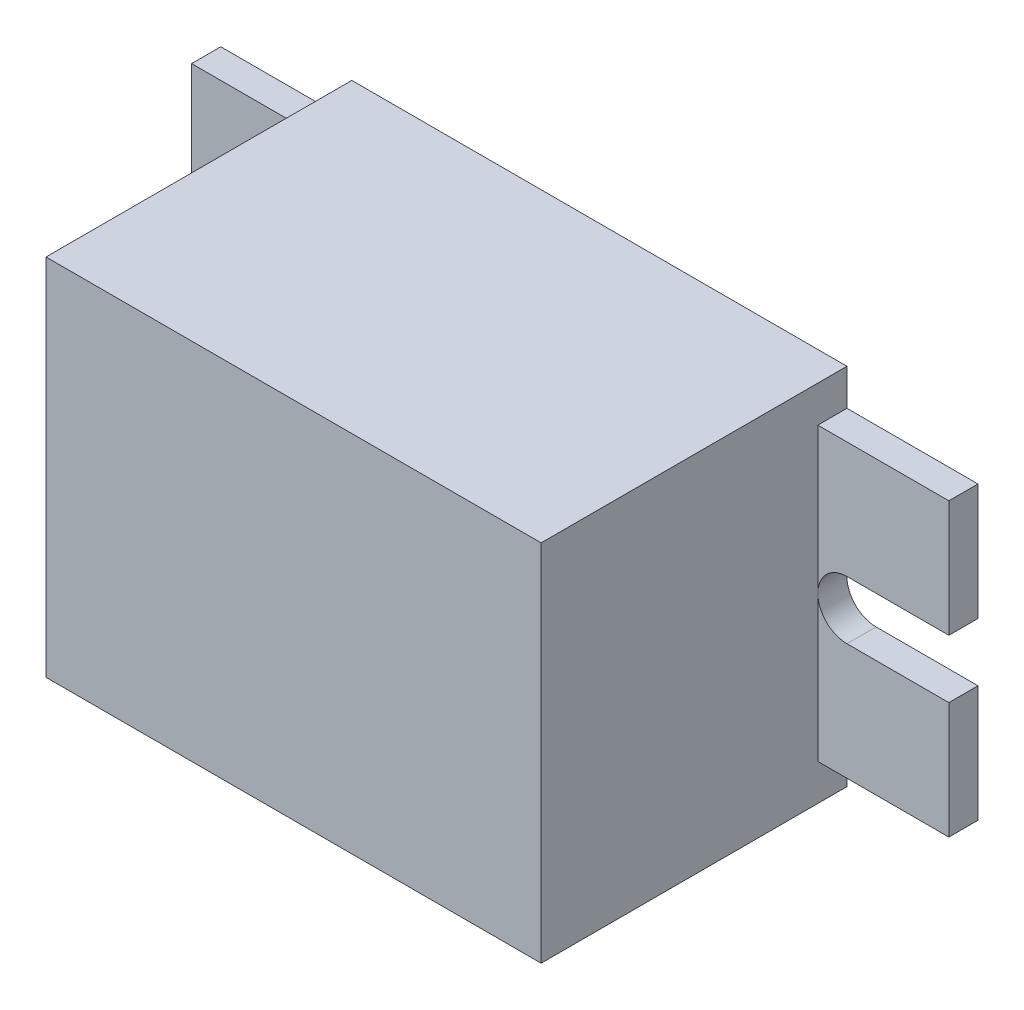
ISO-10303-21;
HEADER;
FILE_DESCRIPTION(('STEP AP214'),'2;1');
FILE_NAME('part.step','',(''),(''),'','','');
FILE_SCHEMA(('AUTOMOTIVE_DESIGN { 1 0 10303 214 1 1 1 1 }'));
ENDSEC;
DATA;
#1=APPLICATION_CONTEXT('core data for automotive mechanical design processes');
#2=APPLICATION_PROTOCOL_DEFINITION('international standard','automotive_design',2000,#1);
#3=PRODUCT_CONTEXT('',#1,'mechanical');
#4=PRODUCT('Part','Part','',(#3));
#5=PRODUCT_RELATED_PRODUCT_CATEGORY('part','',(#4));
#6=PRODUCT_DEFINITION_FORMATION('','',#4);
#7=PRODUCT_DEFINITION_CONTEXT('part definition',#1,'design');
#8=PRODUCT_DEFINITION('design','',#6,#7);
#9=PRODUCT_DEFINITION_SHAPE('','',#8);
#10=(LENGTH_UNIT() NAMED_UNIT(*) SI_UNIT(.MILLI.,.METRE.));
#11=(NAMED_UNIT(*) PLANE_ANGLE_UNIT() SI_UNIT($,.RADIAN.));
#12=(NAMED_UNIT(*) SI_UNIT($,.STERADIAN.) SOLID_ANGLE_UNIT());
#13=UNCERTAINTY_MEASURE_WITH_UNIT(LENGTH_MEASURE(1.E-05),#10,'distance_accuracy_value','');
#14=(GEOMETRIC_REPRESENTATION_CONTEXT(3) GLOBAL_UNCERTAINTY_ASSIGNED_CONTEXT((#13)) GLOBAL_UNIT_ASSIGNED_CONTEXT((#10,
#11,#12)) REPRESENTATION_CONTEXT('',''));
#15=CARTESIAN_POINT('',(0.,0.,0.));
#16=DIRECTION('',(0.,0.,1.));
#17=DIRECTION('',(1.,0.,0.));
#18=AXIS2_PLACEMENT_3D('',#15,#16,#17);
#19=CARTESIAN_POINT('',(34.,0.,21.));
#20=DIRECTION('',(-1.,0.,0.));
#21=DIRECTION('',(0.,-1.,0.));
#22=AXIS2_PLACEMENT_3D('',#19,#20,#21);
#23=PLANE('',#22);
#24=DIRECTION('',(0.,-1.,0.));
#25=VECTOR('',#24,1.);
#26=CARTESIAN_POINT('',(34.,0.,2.));
#27=LINE('',#26,#25);
#28=CARTESIAN_POINT('',(34.,22.5,2.));
#29=VERTEX_POINT('',#28);
#30=CARTESIAN_POINT('',(34.,12.5,2.));
#31=VERTEX_POINT('',#30);
#32=EDGE_CURVE('E50',#29,#31,#27,.T.);
#33=ORIENTED_EDGE('',*,*,#32,.F.);
#34=DIRECTION('',(0.,0.,-1.));
#35=VECTOR('',#34,1.);
#36=CARTESIAN_POINT('',(34.,22.5,2.));
#37=LINE('',#36,#35);
#38=CARTESIAN_POINT('',(34.,22.5,0.));
#39=VERTEX_POINT('',#38);
#40=EDGE_CURVE('E54',#29,#39,#37,.T.);
#41=ORIENTED_EDGE('',*,*,#40,.T.);
#42=DIRECTION('',(0.,1.,0.));
#43=VECTOR('',#42,1.);
#44=CARTESIAN_POINT('',(34.,0.,0.));
#45=LINE('',#44,#43);
#46=CARTESIAN_POINT('',(34.,25.,0.));
#47=VERTEX_POINT('',#46);
#48=EDGE_CURVE('E200',#39,#47,#45,.T.);
#49=ORIENTED_EDGE('',*,*,#48,.T.);
#50=DIRECTION('',(0.,0.,-1.));
#51=VECTOR('',#50,1.);
#52=CARTESIAN_POINT('',(34.,25.,21.));
#53=LINE('',#52,#51);
#54=CARTESIAN_POINT('',(34.,25.,21.));
#55=VERTEX_POINT('',#54);
#56=EDGE_CURVE('E332',#55,#47,#53,.T.);
#57=ORIENTED_EDGE('',*,*,#56,.F.);
#58=DIRECTION('',(0.,1.,0.));
#59=VECTOR('',#58,1.);
#60=CARTESIAN_POINT('',(34.,0.,21.));
#61=LINE('',#60,#59);
#62=CARTESIAN_POINT('',(34.,0.,21.));
#63=VERTEX_POINT('',#62);
#64=EDGE_CURVE('E318',#63,#55,#61,.T.);
#65=ORIENTED_EDGE('',*,*,#64,.F.);
#66=DIRECTION('',(0.,0.,-1.));
#67=VECTOR('',#66,1.);
#68=CARTESIAN_POINT('',(34.,0.,21.));
#69=LINE('',#68,#67);
#70=CARTESIAN_POINT('',(34.,0.,0.));
#71=VERTEX_POINT('',#70);
#72=EDGE_CURVE('E43',#63,#71,#69,.T.);
#73=ORIENTED_EDGE('',*,*,#72,.T.);
#74=CARTESIAN_POINT('',(34.,2.5,0.));
#75=VERTEX_POINT('',#74);
#76=EDGE_CURVE('E327',#71,#75,#45,.T.);
#77=ORIENTED_EDGE('',*,*,#76,.T.);
#78=DIRECTION('',(0.,0.,-1.));
#79=VECTOR('',#78,1.);
#80=CARTESIAN_POINT('',(34.,2.5,2.));
#81=LINE('',#80,#79);
#82=CARTESIAN_POINT('',(34.,2.5,2.));
#83=VERTEX_POINT('',#82);
#84=EDGE_CURVE('E247',#83,#75,#81,.T.);
#85=ORIENTED_EDGE('',*,*,#84,.F.);
#86=DIRECTION('',(0.,-1.,0.));
#87=VECTOR('',#86,1.);
#88=CARTESIAN_POINT('',(34.,0.,2.));
#89=LINE('',#88,#87);
#90=EDGE_CURVE('E219',#31,#83,#89,.T.);
#91=ORIENTED_EDGE('',*,*,#90,.F.);
#92=EDGE_LOOP('',(#33,#41,#49,#57,#65,#73,#77,#85,#91));
#93=FACE_BOUND('',#92,.T.);
#94=ADVANCED_FACE('F35',(#93),#23,.F.);
#95=CARTESIAN_POINT('',(0.,0.,21.));
#96=DIRECTION('',(1.,0.,0.));
#97=DIRECTION('',(0.,1.,0.));
#98=AXIS2_PLACEMENT_3D('',#95,#96,#97);
#99=PLANE('',#98);
#100=DIRECTION('',(0.,-1.,0.));
#101=VECTOR('',#100,1.);
#102=CARTESIAN_POINT('',(0.,0.,2.));
#103=LINE('',#102,#101);
#104=CARTESIAN_POINT('',(0.,12.5,2.));
#105=VERTEX_POINT('',#104);
#106=CARTESIAN_POINT('',(0.,2.49999999999999,2.));
#107=VERTEX_POINT('',#106);
#108=EDGE_CURVE('E250',#105,#107,#103,.T.);
#109=ORIENTED_EDGE('',*,*,#108,.T.);
#110=DIRECTION('',(0.,0.,-1.));
#111=VECTOR('',#110,1.);
#112=CARTESIAN_POINT('',(0.,2.5,2.));
#113=LINE('',#112,#111);
#114=CARTESIAN_POINT('',(0.,2.49999999999999,0.));
#115=VERTEX_POINT('',#114);
#116=EDGE_CURVE('E263',#107,#115,#113,.T.);
#117=ORIENTED_EDGE('',*,*,#116,.T.);
#118=DIRECTION('',(0.,-1.,0.));
#119=VECTOR('',#118,1.);
#120=CARTESIAN_POINT('',(0.,0.,0.));
#121=LINE('',#120,#119);
#122=CARTESIAN_POINT('',(0.,0.,0.));
#123=VERTEX_POINT('',#122);
#124=EDGE_CURVE('E311',#115,#123,#121,.T.);
#125=ORIENTED_EDGE('',*,*,#124,.T.);
#126=DIRECTION('',(0.,0.,-1.));
#127=VECTOR('',#126,1.);
#128=CARTESIAN_POINT('',(0.,0.,21.));
#129=LINE('',#128,#127);
#130=CARTESIAN_POINT('',(0.,0.,21.));
#131=VERTEX_POINT('',#130);
#132=EDGE_CURVE('E11',#131,#123,#129,.T.);
#133=ORIENTED_EDGE('',*,*,#132,.F.);
#134=DIRECTION('',(0.,-1.,0.));
#135=VECTOR('',#134,1.);
#136=CARTESIAN_POINT('',(0.,0.,21.));
#137=LINE('',#136,#135);
#138=CARTESIAN_POINT('',(0.,25.,21.));
#139=VERTEX_POINT('',#138);
#140=EDGE_CURVE('E312',#139,#131,#137,.T.);
#141=ORIENTED_EDGE('',*,*,#140,.F.);
#142=DIRECTION('',(0.,0.,-1.));
#143=VECTOR('',#142,1.);
#144=CARTESIAN_POINT('',(0.,25.,21.));
#145=LINE('',#144,#143);
#146=CARTESIAN_POINT('',(0.,25.,0.));
#147=VERTEX_POINT('',#146);
#148=EDGE_CURVE('E322',#139,#147,#145,.T.);
#149=ORIENTED_EDGE('',*,*,#148,.T.);
#150=CARTESIAN_POINT('',(0.,22.5,0.));
#151=VERTEX_POINT('',#150);
#152=EDGE_CURVE('E323',#147,#151,#121,.T.);
#153=ORIENTED_EDGE('',*,*,#152,.T.);
#154=DIRECTION('',(0.,0.,-1.));
#155=VECTOR('',#154,1.);
#156=CARTESIAN_POINT('',(0.,22.5,2.));
#157=LINE('',#156,#155);
#158=CARTESIAN_POINT('',(0.,22.5,2.));
#159=VERTEX_POINT('',#158);
#160=EDGE_CURVE('E306',#159,#151,#157,.T.);
#161=ORIENTED_EDGE('',*,*,#160,.F.);
#162=DIRECTION('',(0.,-1.,0.));
#163=VECTOR('',#162,1.);
#164=CARTESIAN_POINT('',(0.,0.,2.));
#165=LINE('',#164,#163);
#166=EDGE_CURVE('E287',#159,#105,#165,.T.);
#167=ORIENTED_EDGE('',*,*,#166,.T.);
#168=EDGE_LOOP('',(#109,#117,#125,#133,#141,#149,#153,#161,#167));
#169=FACE_BOUND('',#168,.T.);
#170=ADVANCED_FACE('F37',(#169),#99,.F.);
#171=CARTESIAN_POINT('',(0.,0.,21.));
#172=DIRECTION('',(0.,1.,0.));
#173=DIRECTION('',(0.,0.,1.));
#174=AXIS2_PLACEMENT_3D('',#171,#172,#173);
#175=PLANE('',#174);
#176=DIRECTION('',(1.,0.,0.));
#177=VECTOR('',#176,1.);
#178=CARTESIAN_POINT('',(0.,0.,0.));
#179=LINE('',#178,#177);
#180=EDGE_CURVE('E325',#123,#71,#179,.T.);
#181=ORIENTED_EDGE('',*,*,#180,.T.);
#182=ORIENTED_EDGE('',*,*,#72,.F.);
#183=DIRECTION('',(1.,0.,0.));
#184=VECTOR('',#183,1.);
#185=CARTESIAN_POINT('',(0.,0.,21.));
#186=LINE('',#185,#184);
#187=EDGE_CURVE('E315',#131,#63,#186,.T.);
#188=ORIENTED_EDGE('',*,*,#187,.F.);
#189=ORIENTED_EDGE('',*,*,#132,.T.);
#190=EDGE_LOOP('',(#181,#182,#188,#189));
#191=FACE_BOUND('',#190,.T.);
#192=ADVANCED_FACE('F382',(#191),#175,.F.);
#193=CARTESIAN_POINT('',(0.,25.,21.));
#194=DIRECTION('',(0.,-1.,0.));
#195=DIRECTION('',(0.,0.,-1.));
#196=AXIS2_PLACEMENT_3D('',#193,#194,#195);
#197=PLANE('',#196);
#198=DIRECTION('',(-1.,0.,0.));
#199=VECTOR('',#198,1.);
#200=CARTESIAN_POINT('',(0.,25.,0.));
#201=LINE('',#200,#199);
#202=EDGE_CURVE('E316',#47,#147,#201,.T.);
#203=ORIENTED_EDGE('',*,*,#202,.T.);
#204=ORIENTED_EDGE('',*,*,#148,.F.);
#205=DIRECTION('',(-1.,0.,0.));
#206=VECTOR('',#205,1.);
#207=CARTESIAN_POINT('',(0.,25.,21.));
#208=LINE('',#207,#206);
#209=EDGE_CURVE('E320',#55,#139,#208,.T.);
#210=ORIENTED_EDGE('',*,*,#209,.F.);
#211=ORIENTED_EDGE('',*,*,#56,.T.);
#212=EDGE_LOOP('',(#203,#204,#210,#211));
#213=FACE_BOUND('',#212,.T.);
#214=ADVANCED_FACE('F385',(#213),#197,.F.);
#215=CARTESIAN_POINT('',(0.,0.,21.));
#216=DIRECTION('',(0.,0.,-1.));
#217=DIRECTION('',(-1.,0.,0.));
#218=AXIS2_PLACEMENT_3D('',#215,#216,#217);
#219=PLANE('',#218);
#220=ORIENTED_EDGE('',*,*,#140,.T.);
#221=ORIENTED_EDGE('',*,*,#187,.T.);
#222=ORIENTED_EDGE('',*,*,#64,.T.);
#223=ORIENTED_EDGE('',*,*,#209,.T.);
#224=EDGE_LOOP('',(#220,#221,#222,#223));
#225=FACE_BOUND('',#224,.T.);
#226=ADVANCED_FACE('F391',(#225),#219,.F.);
#227=CARTESIAN_POINT('',(0.,0.,0.));
#228=DIRECTION('',(0.,0.,-1.));
#229=DIRECTION('',(-1.,0.,0.));
#230=AXIS2_PLACEMENT_3D('',#227,#228,#229);
#231=PLANE('',#230);
#232=ORIENTED_EDGE('',*,*,#152,.F.);
#233=ORIENTED_EDGE('',*,*,#202,.F.);
#234=ORIENTED_EDGE('',*,*,#48,.F.);
#235=DIRECTION('',(1.,0.,0.));
#236=VECTOR('',#235,1.);
#237=CARTESIAN_POINT('',(0.,22.5,0.));
#238=LINE('',#237,#236);
#239=CARTESIAN_POINT('',(43.,22.5,0.));
#240=VERTEX_POINT('',#239);
#241=EDGE_CURVE('E180',#39,#240,#238,.T.);
#242=ORIENTED_EDGE('',*,*,#241,.T.);
#243=DIRECTION('',(0.,-1.,0.));
#244=VECTOR('',#243,1.);
#245=CARTESIAN_POINT('',(43.,0.,0.));
#246=LINE('',#245,#244);
#247=CARTESIAN_POINT('',(43.,14.5,0.));
#248=VERTEX_POINT('',#247);
#249=EDGE_CURVE('E188',#240,#248,#246,.T.);
#250=ORIENTED_EDGE('',*,*,#249,.T.);
#251=DIRECTION('',(1.,0.,0.));
#252=VECTOR('',#251,1.);
#253=CARTESIAN_POINT('',(0.,14.5,0.));
#254=LINE('',#253,#252);
#255=CARTESIAN_POINT('',(36.,14.5,0.));
#256=VERTEX_POINT('',#255);
#257=EDGE_CURVE('E206',#256,#248,#254,.T.);
#258=ORIENTED_EDGE('',*,*,#257,.F.);
#259=CARTESIAN_POINT('',(36.,12.5,0.));
#260=DIRECTION('',(0.,0.,1.));
#261=DIRECTION('',(1.,0.,0.));
#262=AXIS2_PLACEMENT_3D('',#259,#260,#261);
#263=CIRCLE('',#262,2.);
#264=CARTESIAN_POINT('',(36.,10.5,0.));
#265=VERTEX_POINT('',#264);
#266=EDGE_CURVE('E195',#256,#265,#263,.T.);
#267=ORIENTED_EDGE('',*,*,#266,.T.);
#268=DIRECTION('',(1.,0.,0.));
#269=VECTOR('',#268,1.);
#270=CARTESIAN_POINT('',(0.,10.5,0.));
#271=LINE('',#270,#269);
#272=CARTESIAN_POINT('',(43.,10.5,0.));
#273=VERTEX_POINT('',#272);
#274=EDGE_CURVE('E220',#265,#273,#271,.T.);
#275=ORIENTED_EDGE('',*,*,#274,.T.);
#276=DIRECTION('',(0.,-1.,0.));
#277=VECTOR('',#276,1.);
#278=CARTESIAN_POINT('',(43.,0.,0.));
#279=LINE('',#278,#277);
#280=CARTESIAN_POINT('',(43.,2.5,0.));
#281=VERTEX_POINT('',#280);
#282=EDGE_CURVE('E237',#273,#281,#279,.T.);
#283=ORIENTED_EDGE('',*,*,#282,.T.);
#284=DIRECTION('',(1.,0.,0.));
#285=VECTOR('',#284,1.);
#286=CARTESIAN_POINT('',(0.,2.50000000000001,0.));
#287=LINE('',#286,#285);
#288=EDGE_CURVE('E234',#75,#281,#287,.T.);
#289=ORIENTED_EDGE('',*,*,#288,.F.);
#290=ORIENTED_EDGE('',*,*,#76,.F.);
#291=ORIENTED_EDGE('',*,*,#180,.F.);
#292=ORIENTED_EDGE('',*,*,#124,.F.);
#293=DIRECTION('',(-1.,0.,0.));
#294=VECTOR('',#293,1.);
#295=CARTESIAN_POINT('',(0.,2.5,0.));
#296=LINE('',#295,#294);
#297=CARTESIAN_POINT('',(-9.00000000000001,2.49999999999999,0.));
#298=VERTEX_POINT('',#297);
#299=EDGE_CURVE('E265',#115,#298,#296,.T.);
#300=ORIENTED_EDGE('',*,*,#299,.T.);
#301=DIRECTION('',(0.,-1.,0.));
#302=VECTOR('',#301,1.);
#303=CARTESIAN_POINT('',(-9.00000000000001,0.,0.));
#304=LINE('',#303,#302);
#305=CARTESIAN_POINT('',(-9.00000000000001,10.5,0.));
#306=VERTEX_POINT('',#305);
#307=EDGE_CURVE('E254',#306,#298,#304,.T.);
#308=ORIENTED_EDGE('',*,*,#307,.F.);
#309=DIRECTION('',(-1.,0.,0.));
#310=VECTOR('',#309,1.);
#311=CARTESIAN_POINT('',(0.,10.5,0.));
#312=LINE('',#311,#310);
#313=CARTESIAN_POINT('',(-2.00000000000001,10.5,0.));
#314=VERTEX_POINT('',#313);
#315=EDGE_CURVE('E255',#314,#306,#312,.T.);
#316=ORIENTED_EDGE('',*,*,#315,.F.);
#317=CARTESIAN_POINT('',(-2.00000000000001,12.5,0.));
#318=DIRECTION('',(0.,0.,1.));
#319=DIRECTION('',(1.,0.,0.));
#320=AXIS2_PLACEMENT_3D('',#317,#318,#319);
#321=CIRCLE('',#320,2.);
#322=CARTESIAN_POINT('',(-2.00000000000001,14.5,0.));
#323=VERTEX_POINT('',#322);
#324=EDGE_CURVE('E296',#323,#314,#321,.F.);
#325=ORIENTED_EDGE('',*,*,#324,.F.);
#326=DIRECTION('',(-1.,0.,0.));
#327=VECTOR('',#326,1.);
#328=CARTESIAN_POINT('',(0.,14.5,0.));
#329=LINE('',#328,#327);
#330=CARTESIAN_POINT('',(-9.00000000000001,14.5,0.));
#331=VERTEX_POINT('',#330);
#332=EDGE_CURVE('E268',#323,#331,#329,.T.);
#333=ORIENTED_EDGE('',*,*,#332,.T.);
#334=DIRECTION('',(0.,-1.,0.));
#335=VECTOR('',#334,1.);
#336=CARTESIAN_POINT('',(-9.,0.,0.));
#337=LINE('',#336,#335);
#338=CARTESIAN_POINT('',(-9.00000000000001,22.5,0.));
#339=VERTEX_POINT('',#338);
#340=EDGE_CURVE('E284',#339,#331,#337,.T.);
#341=ORIENTED_EDGE('',*,*,#340,.F.);
#342=DIRECTION('',(-1.,0.,0.));
#343=VECTOR('',#342,1.);
#344=CARTESIAN_POINT('',(0.,22.5,0.));
#345=LINE('',#344,#343);
#346=EDGE_CURVE('E298',#151,#339,#345,.T.);
#347=ORIENTED_EDGE('',*,*,#346,.F.);
#348=EDGE_LOOP('',(#232,#233,#234,#242,#250,#258,#267,#275,#283,#289,#290,#291,#292,#300,#308,
#316,#325,#333,#341,#347));
#349=FACE_BOUND('',#348,.T.);
#350=ADVANCED_FACE('F198',(#349),#231,.T.);
#351=CARTESIAN_POINT('',(0.,14.5,2.));
#352=DIRECTION('',(0.,-1.,0.));
#353=DIRECTION('',(1.,0.,0.));
#354=AXIS2_PLACEMENT_3D('',#351,#352,#353);
#355=PLANE('',#354);
#356=ORIENTED_EDGE('',*,*,#332,.F.);
#357=DIRECTION('',(0.,0.,-1.));
#358=VECTOR('',#357,1.);
#359=CARTESIAN_POINT('',(-2.00000000000001,14.5,2.));
#360=LINE('',#359,#358);
#361=CARTESIAN_POINT('',(-2.00000000000001,14.5,2.));
#362=VERTEX_POINT('',#361);
#363=EDGE_CURVE('E309',#362,#323,#360,.T.);
#364=ORIENTED_EDGE('',*,*,#363,.F.);
#365=DIRECTION('',(-1.,0.,0.));
#366=VECTOR('',#365,1.);
#367=CARTESIAN_POINT('',(0.,14.5,2.));
#368=LINE('',#367,#366);
#369=CARTESIAN_POINT('',(-9.00000000000001,14.5,2.));
#370=VERTEX_POINT('',#369);
#371=EDGE_CURVE('E280',#362,#370,#368,.T.);
#372=ORIENTED_EDGE('',*,*,#371,.T.);
#373=DIRECTION('',(0.,0.,-1.));
#374=VECTOR('',#373,1.);
#375=CARTESIAN_POINT('',(-9.00000000000001,14.5,2.));
#376=LINE('',#375,#374);
#377=EDGE_CURVE('E293',#370,#331,#376,.T.);
#378=ORIENTED_EDGE('',*,*,#377,.T.);
#379=EDGE_LOOP('',(#356,#364,#372,#378));
#380=FACE_BOUND('',#379,.T.);
#381=ADVANCED_FACE('F420',(#380),#355,.T.);
#382=CARTESIAN_POINT('',(-2.00000000000001,12.5,2.));
#383=DIRECTION('',(0.,0.,-1.));
#384=DIRECTION('',(-1.,0.,0.));
#385=AXIS2_PLACEMENT_3D('',#382,#383,#384);
#386=CYLINDRICAL_SURFACE('',#385,2.);
#387=ORIENTED_EDGE('',*,*,#324,.T.);
#388=DIRECTION('',(0.,0.,-1.));
#389=VECTOR('',#388,1.);
#390=CARTESIAN_POINT('',(-2.00000000000001,10.5,2.));
#391=LINE('',#390,#389);
#392=CARTESIAN_POINT('',(-2.00000000000001,10.5,2.));
#393=VERTEX_POINT('',#392);
#394=EDGE_CURVE('E251',#393,#314,#391,.T.);
#395=ORIENTED_EDGE('',*,*,#394,.F.);
#396=CARTESIAN_POINT('',(-2.00000000000001,12.5,2.));
#397=DIRECTION('',(0.,0.,1.));
#398=DIRECTION('',(1.,0.,0.));
#399=AXIS2_PLACEMENT_3D('',#396,#397,#398);
#400=CIRCLE('',#399,2.);
#401=EDGE_CURVE('E262',#105,#393,#400,.F.);
#402=ORIENTED_EDGE('',*,*,#401,.F.);
#403=CARTESIAN_POINT('',(-2.00000000000001,12.5,2.));
#404=DIRECTION('',(0.,0.,1.));
#405=DIRECTION('',(1.,0.,0.));
#406=AXIS2_PLACEMENT_3D('',#403,#404,#405);
#407=CIRCLE('',#406,2.);
#408=EDGE_CURVE('E283',#362,#105,#407,.F.);
#409=ORIENTED_EDGE('',*,*,#408,.F.);
#410=ORIENTED_EDGE('',*,*,#363,.T.);
#411=EDGE_LOOP('',(#387,#395,#402,#409,#410));
#412=FACE_BOUND('',#411,.T.);
#413=ADVANCED_FACE('F415',(#412),#386,.F.);
#414=CARTESIAN_POINT('',(0.,22.5,2.));
#415=DIRECTION('',(0.,-1.,0.));
#416=DIRECTION('',(0.,0.,-1.));
#417=AXIS2_PLACEMENT_3D('',#414,#415,#416);
#418=PLANE('',#417);
#419=ORIENTED_EDGE('',*,*,#346,.T.);
#420=DIRECTION('',(0.,0.,-1.));
#421=VECTOR('',#420,1.);
#422=CARTESIAN_POINT('',(-9.00000000000001,22.5,2.));
#423=LINE('',#422,#421);
#424=CARTESIAN_POINT('',(-9.00000000000001,22.5,2.));
#425=VERTEX_POINT('',#424);
#426=EDGE_CURVE('E303',#425,#339,#423,.T.);
#427=ORIENTED_EDGE('',*,*,#426,.F.);
#428=DIRECTION('',(-1.,0.,0.));
#429=VECTOR('',#428,1.);
#430=CARTESIAN_POINT('',(0.,22.5,2.));
#431=LINE('',#430,#429);
#432=EDGE_CURVE('E289',#159,#425,#431,.T.);
#433=ORIENTED_EDGE('',*,*,#432,.F.);
#434=ORIENTED_EDGE('',*,*,#160,.T.);
#435=EDGE_LOOP('',(#419,#427,#433,#434));
#436=FACE_BOUND('',#435,.T.);
#437=ADVANCED_FACE('F430',(#436),#418,.F.);
#438=CARTESIAN_POINT('',(-9.,0.,2.));
#439=DIRECTION('',(1.,0.,0.));
#440=DIRECTION('',(0.,1.,0.));
#441=AXIS2_PLACEMENT_3D('',#438,#439,#440);
#442=PLANE('',#441);
#443=ORIENTED_EDGE('',*,*,#340,.T.);
#444=ORIENTED_EDGE('',*,*,#377,.F.);
#445=DIRECTION('',(0.,-1.,0.));
#446=VECTOR('',#445,1.);
#447=CARTESIAN_POINT('',(-9.,0.,2.));
#448=LINE('',#447,#446);
#449=EDGE_CURVE('E291',#425,#370,#448,.T.);
#450=ORIENTED_EDGE('',*,*,#449,.F.);
#451=ORIENTED_EDGE('',*,*,#426,.T.);
#452=EDGE_LOOP('',(#443,#444,#450,#451));
#453=FACE_BOUND('',#452,.T.);
#454=ADVANCED_FACE('F425',(#453),#442,.F.);
#455=CARTESIAN_POINT('',(0.,0.,2.));
#456=DIRECTION('',(0.,0.,1.));
#457=DIRECTION('',(1.,0.,0.));
#458=AXIS2_PLACEMENT_3D('',#455,#456,#457);
#459=PLANE('',#458);
#460=ORIENTED_EDGE('',*,*,#371,.F.);
#461=ORIENTED_EDGE('',*,*,#408,.T.);
#462=ORIENTED_EDGE('',*,*,#166,.F.);
#463=ORIENTED_EDGE('',*,*,#432,.T.);
#464=ORIENTED_EDGE('',*,*,#449,.T.);
#465=EDGE_LOOP('',(#460,#461,#462,#463,#464));
#466=FACE_BOUND('',#465,.T.);
#467=ADVANCED_FACE('F449',(#466),#459,.T.);
#468=CARTESIAN_POINT('',(0.,10.5,2.));
#469=DIRECTION('',(0.,-1.,0.));
#470=DIRECTION('',(1.,0.,0.));
#471=AXIS2_PLACEMENT_3D('',#468,#469,#470);
#472=PLANE('',#471);
#473=ORIENTED_EDGE('',*,*,#315,.T.);
#474=DIRECTION('',(0.,0.,-1.));
#475=VECTOR('',#474,1.);
#476=CARTESIAN_POINT('',(-9.00000000000001,10.5,2.));
#477=LINE('',#476,#475);
#478=CARTESIAN_POINT('',(-9.00000000000001,10.5,2.));
#479=VERTEX_POINT('',#478);
#480=EDGE_CURVE('E256',#479,#306,#477,.T.);
#481=ORIENTED_EDGE('',*,*,#480,.F.);
#482=DIRECTION('',(-1.,0.,0.));
#483=VECTOR('',#482,1.);
#484=CARTESIAN_POINT('',(0.,10.5,2.));
#485=LINE('',#484,#483);
#486=EDGE_CURVE('E276',#393,#479,#485,.T.);
#487=ORIENTED_EDGE('',*,*,#486,.F.);
#488=ORIENTED_EDGE('',*,*,#394,.T.);
#489=EDGE_LOOP('',(#473,#481,#487,#488));
#490=FACE_BOUND('',#489,.T.);
#491=ADVANCED_FACE('F410',(#490),#472,.F.);
#492=CARTESIAN_POINT('',(-9.00000000000001,0.,2.));
#493=DIRECTION('',(1.,0.,0.));
#494=DIRECTION('',(0.,1.,0.));
#495=AXIS2_PLACEMENT_3D('',#492,#493,#494);
#496=PLANE('',#495);
#497=ORIENTED_EDGE('',*,*,#307,.T.);
#498=DIRECTION('',(0.,0.,-1.));
#499=VECTOR('',#498,1.);
#500=CARTESIAN_POINT('',(-9.00000000000001,2.49999999999999,2.));
#501=LINE('',#500,#499);
#502=CARTESIAN_POINT('',(-9.00000000000001,2.49999999999999,2.));
#503=VERTEX_POINT('',#502);
#504=EDGE_CURVE('E260',#503,#298,#501,.T.);
#505=ORIENTED_EDGE('',*,*,#504,.F.);
#506=DIRECTION('',(0.,-1.,0.));
#507=VECTOR('',#506,1.);
#508=CARTESIAN_POINT('',(-9.00000000000001,0.,2.));
#509=LINE('',#508,#507);
#510=EDGE_CURVE('E269',#479,#503,#509,.T.);
#511=ORIENTED_EDGE('',*,*,#510,.F.);
#512=ORIENTED_EDGE('',*,*,#480,.T.);
#513=EDGE_LOOP('',(#497,#505,#511,#512));
#514=FACE_BOUND('',#513,.T.);
#515=ADVANCED_FACE('F404',(#514),#496,.F.);
#516=CARTESIAN_POINT('',(0.,2.5,2.));
#517=DIRECTION('',(0.,-1.,0.));
#518=DIRECTION('',(1.,0.,0.));
#519=AXIS2_PLACEMENT_3D('',#516,#517,#518);
#520=PLANE('',#519);
#521=ORIENTED_EDGE('',*,*,#299,.F.);
#522=ORIENTED_EDGE('',*,*,#116,.F.);
#523=DIRECTION('',(-1.,0.,0.));
#524=VECTOR('',#523,1.);
#525=CARTESIAN_POINT('',(0.,2.5,2.));
#526=LINE('',#525,#524);
#527=EDGE_CURVE('E259',#107,#503,#526,.T.);
#528=ORIENTED_EDGE('',*,*,#527,.T.);
#529=ORIENTED_EDGE('',*,*,#504,.T.);
#530=EDGE_LOOP('',(#521,#522,#528,#529));
#531=FACE_BOUND('',#530,.T.);
#532=ADVANCED_FACE('F399',(#531),#520,.T.);
#533=CARTESIAN_POINT('',(0.,0.,2.));
#534=DIRECTION('',(0.,0.,1.));
#535=DIRECTION('',(1.,0.,0.));
#536=AXIS2_PLACEMENT_3D('',#533,#534,#535);
#537=PLANE('',#536);
#538=ORIENTED_EDGE('',*,*,#108,.F.);
#539=ORIENTED_EDGE('',*,*,#401,.T.);
#540=ORIENTED_EDGE('',*,*,#486,.T.);
#541=ORIENTED_EDGE('',*,*,#510,.T.);
#542=ORIENTED_EDGE('',*,*,#527,.F.);
#543=EDGE_LOOP('',(#538,#539,#540,#541,#542));
#544=FACE_BOUND('',#543,.T.);
#545=ADVANCED_FACE('F453',(#544),#537,.T.);
#546=CARTESIAN_POINT('',(36.,12.5,2.));
#547=DIRECTION('',(0.,0.,-1.));
#548=DIRECTION('',(-1.,0.,0.));
#549=AXIS2_PLACEMENT_3D('',#546,#547,#548);
#550=CYLINDRICAL_SURFACE('',#549,2.);
#551=ORIENTED_EDGE('',*,*,#266,.F.);
#552=DIRECTION('',(0.,0.,-1.));
#553=VECTOR('',#552,1.);
#554=CARTESIAN_POINT('',(36.,14.5,2.));
#555=LINE('',#554,#553);
#556=CARTESIAN_POINT('',(36.,14.5,2.));
#557=VERTEX_POINT('',#556);
#558=EDGE_CURVE('E207',#557,#256,#555,.T.);
#559=ORIENTED_EDGE('',*,*,#558,.F.);
#560=CARTESIAN_POINT('',(36.,12.5,2.));
#561=DIRECTION('',(0.,0.,1.));
#562=DIRECTION('',(1.,0.,0.));
#563=AXIS2_PLACEMENT_3D('',#560,#561,#562);
#564=CIRCLE('',#563,2.);
#565=EDGE_CURVE('E208',#557,#31,#564,.T.);
#566=ORIENTED_EDGE('',*,*,#565,.T.);
#567=CARTESIAN_POINT('',(36.,12.5,2.));
#568=DIRECTION('',(0.,0.,1.));
#569=DIRECTION('',(1.,0.,0.));
#570=AXIS2_PLACEMENT_3D('',#567,#568,#569);
#571=CIRCLE('',#570,2.);
#572=CARTESIAN_POINT('',(36.,10.5,2.));
#573=VERTEX_POINT('',#572);
#574=EDGE_CURVE('E216',#31,#573,#571,.T.);
#575=ORIENTED_EDGE('',*,*,#574,.T.);
#576=DIRECTION('',(0.,0.,-1.));
#577=VECTOR('',#576,1.);
#578=CARTESIAN_POINT('',(36.,10.5,2.));
#579=LINE('',#578,#577);
#580=EDGE_CURVE('E231',#573,#265,#579,.T.);
#581=ORIENTED_EDGE('',*,*,#580,.T.);
#582=EDGE_LOOP('',(#551,#559,#566,#575,#581));
#583=FACE_BOUND('',#582,.T.);
#584=ADVANCED_FACE('F357',(#583),#550,.F.);
#585=CARTESIAN_POINT('',(0.,2.50000000000001,2.));
#586=DIRECTION('',(0.,1.,0.));
#587=DIRECTION('',(-1.,0.,0.));
#588=AXIS2_PLACEMENT_3D('',#585,#586,#587);
#589=PLANE('',#588);
#590=ORIENTED_EDGE('',*,*,#288,.T.);
#591=DIRECTION('',(0.,0.,-1.));
#592=VECTOR('',#591,1.);
#593=CARTESIAN_POINT('',(43.,2.5,2.));
#594=LINE('',#593,#592);
#595=CARTESIAN_POINT('',(43.,2.5,2.));
#596=VERTEX_POINT('',#595);
#597=EDGE_CURVE('E245',#596,#281,#594,.T.);
#598=ORIENTED_EDGE('',*,*,#597,.F.);
#599=DIRECTION('',(1.,0.,0.));
#600=VECTOR('',#599,1.);
#601=CARTESIAN_POINT('',(0.,2.50000000000001,2.));
#602=LINE('',#601,#600);
#603=EDGE_CURVE('E223',#83,#596,#602,.T.);
#604=ORIENTED_EDGE('',*,*,#603,.F.);
#605=ORIENTED_EDGE('',*,*,#84,.T.);
#606=EDGE_LOOP('',(#590,#598,#604,#605));
#607=FACE_BOUND('',#606,.T.);
#608=ADVANCED_FACE('F346',(#607),#589,.F.);
#609=CARTESIAN_POINT('',(43.,0.,2.));
#610=DIRECTION('',(1.,0.,0.));
#611=DIRECTION('',(0.,0.,-1.));
#612=AXIS2_PLACEMENT_3D('',#609,#610,#611);
#613=PLANE('',#612);
#614=ORIENTED_EDGE('',*,*,#282,.F.);
#615=DIRECTION('',(0.,0.,-1.));
#616=VECTOR('',#615,1.);
#617=CARTESIAN_POINT('',(43.,10.5,2.));
#618=LINE('',#617,#616);
#619=CARTESIAN_POINT('',(43.,10.5,2.));
#620=VERTEX_POINT('',#619);
#621=EDGE_CURVE('E243',#620,#273,#618,.T.);
#622=ORIENTED_EDGE('',*,*,#621,.F.);
#623=DIRECTION('',(0.,-1.,0.));
#624=VECTOR('',#623,1.);
#625=CARTESIAN_POINT('',(43.,0.,2.));
#626=LINE('',#625,#624);
#627=EDGE_CURVE('E225',#620,#596,#626,.T.);
#628=ORIENTED_EDGE('',*,*,#627,.T.);
#629=ORIENTED_EDGE('',*,*,#597,.T.);
#630=EDGE_LOOP('',(#614,#622,#628,#629));
#631=FACE_BOUND('',#630,.T.);
#632=ADVANCED_FACE('F368',(#631),#613,.T.);
#633=CARTESIAN_POINT('',(0.,10.5,2.));
#634=DIRECTION('',(0.,1.,0.));
#635=DIRECTION('',(0.,0.,1.));
#636=AXIS2_PLACEMENT_3D('',#633,#634,#635);
#637=PLANE('',#636);
#638=ORIENTED_EDGE('',*,*,#274,.F.);
#639=ORIENTED_EDGE('',*,*,#580,.F.);
#640=DIRECTION('',(1.,0.,0.));
#641=VECTOR('',#640,1.);
#642=CARTESIAN_POINT('',(0.,10.5,2.));
#643=LINE('',#642,#641);
#644=EDGE_CURVE('E228',#573,#620,#643,.T.);
#645=ORIENTED_EDGE('',*,*,#644,.T.);
#646=ORIENTED_EDGE('',*,*,#621,.T.);
#647=EDGE_LOOP('',(#638,#639,#645,#646));
#648=FACE_BOUND('',#647,.T.);
#649=ADVANCED_FACE('F366',(#648),#637,.T.);
#650=CARTESIAN_POINT('',(0.,0.,2.));
#651=DIRECTION('',(0.,0.,1.));
#652=DIRECTION('',(1.,0.,0.));
#653=AXIS2_PLACEMENT_3D('',#650,#651,#652);
#654=PLANE('',#653);
#655=ORIENTED_EDGE('',*,*,#574,.F.);
#656=ORIENTED_EDGE('',*,*,#90,.T.);
#657=ORIENTED_EDGE('',*,*,#603,.T.);
#658=ORIENTED_EDGE('',*,*,#627,.F.);
#659=ORIENTED_EDGE('',*,*,#644,.F.);
#660=EDGE_LOOP('',(#655,#656,#657,#658,#659));
#661=FACE_BOUND('',#660,.T.);
#662=ADVANCED_FACE('F350',(#661),#654,.T.);
#663=CARTESIAN_POINT('',(0.,14.5,2.));
#664=DIRECTION('',(0.,1.,0.));
#665=DIRECTION('',(0.,0.,1.));
#666=AXIS2_PLACEMENT_3D('',#663,#664,#665);
#667=PLANE('',#666);
#668=ORIENTED_EDGE('',*,*,#257,.T.);
#669=DIRECTION('',(0.,0.,-1.));
#670=VECTOR('',#669,1.);
#671=CARTESIAN_POINT('',(43.,14.5,2.));
#672=LINE('',#671,#670);
#673=CARTESIAN_POINT('',(43.,14.5,2.));
#674=VERTEX_POINT('',#673);
#675=EDGE_CURVE('E191',#674,#248,#672,.T.);
#676=ORIENTED_EDGE('',*,*,#675,.F.);
#677=DIRECTION('',(1.,0.,0.));
#678=VECTOR('',#677,1.);
#679=CARTESIAN_POINT('',(0.,14.5,2.));
#680=LINE('',#679,#678);
#681=EDGE_CURVE('E202',#557,#674,#680,.T.);
#682=ORIENTED_EDGE('',*,*,#681,.F.);
#683=ORIENTED_EDGE('',*,*,#558,.T.);
#684=EDGE_LOOP('',(#668,#676,#682,#683));
#685=FACE_BOUND('',#684,.T.);
#686=ADVANCED_FACE('F362',(#685),#667,.F.);
#687=CARTESIAN_POINT('',(43.,0.,2.));
#688=DIRECTION('',(1.,0.,0.));
#689=DIRECTION('',(0.,0.,-1.));
#690=AXIS2_PLACEMENT_3D('',#687,#688,#689);
#691=PLANE('',#690);
#692=ORIENTED_EDGE('',*,*,#249,.F.);
#693=DIRECTION('',(0.,0.,-1.));
#694=VECTOR('',#693,1.);
#695=CARTESIAN_POINT('',(43.,22.5,2.));
#696=LINE('',#695,#694);
#697=CARTESIAN_POINT('',(43.,22.5,2.));
#698=VERTEX_POINT('',#697);
#699=EDGE_CURVE('E176',#698,#240,#696,.T.);
#700=ORIENTED_EDGE('',*,*,#699,.F.);
#701=DIRECTION('',(0.,-1.,0.));
#702=VECTOR('',#701,1.);
#703=CARTESIAN_POINT('',(43.,0.,2.));
#704=LINE('',#703,#702);
#705=EDGE_CURVE('E211',#698,#674,#704,.T.);
#706=ORIENTED_EDGE('',*,*,#705,.T.);
#707=ORIENTED_EDGE('',*,*,#675,.T.);
#708=EDGE_LOOP('',(#692,#700,#706,#707));
#709=FACE_BOUND('',#708,.T.);
#710=ADVANCED_FACE('F189',(#709),#691,.T.);
#711=CARTESIAN_POINT('',(0.,22.5,2.));
#712=DIRECTION('',(0.,1.,0.));
#713=DIRECTION('',(-1.,0.,0.));
#714=AXIS2_PLACEMENT_3D('',#711,#712,#713);
#715=PLANE('',#714);
#716=ORIENTED_EDGE('',*,*,#241,.F.);
#717=ORIENTED_EDGE('',*,*,#40,.F.);
#718=DIRECTION('',(1.,0.,0.));
#719=VECTOR('',#718,1.);
#720=CARTESIAN_POINT('',(0.,22.5,2.));
#721=LINE('',#720,#719);
#722=EDGE_CURVE('E182',#29,#698,#721,.T.);
#723=ORIENTED_EDGE('',*,*,#722,.T.);
#724=ORIENTED_EDGE('',*,*,#699,.T.);
#725=EDGE_LOOP('',(#716,#717,#723,#724));
#726=FACE_BOUND('',#725,.T.);
#727=ADVANCED_FACE('F178',(#726),#715,.T.);
#728=CARTESIAN_POINT('',(0.,0.,2.));
#729=DIRECTION('',(0.,0.,1.));
#730=DIRECTION('',(1.,0.,0.));
#731=AXIS2_PLACEMENT_3D('',#728,#729,#730);
#732=PLANE('',#731);
#733=ORIENTED_EDGE('',*,*,#565,.F.);
#734=ORIENTED_EDGE('',*,*,#681,.T.);
#735=ORIENTED_EDGE('',*,*,#705,.F.);
#736=ORIENTED_EDGE('',*,*,#722,.F.);
#737=ORIENTED_EDGE('',*,*,#32,.T.);
#738=EDGE_LOOP('',(#733,#734,#735,#736,#737));
#739=FACE_BOUND('',#738,.T.);
#740=ADVANCED_FACE('F356',(#739),#732,.T.);
#741=CLOSED_SHELL('',(#94,#170,#192,#214,#226,#350,#381,#413,#437,#454,#467,#491,#515,#532,#545,
#584,#608,#632,#649,#662,#686,#710,#727,#740));
#742=MANIFOLD_SOLID_BREP('B2',#741);
#743=ADVANCED_BREP_SHAPE_REPRESENTATION('',(#18,#742),#14);
#744=SHAPE_DEFINITION_REPRESENTATION(#9,#743);
ENDSEC;
END-ISO-10303-21;
